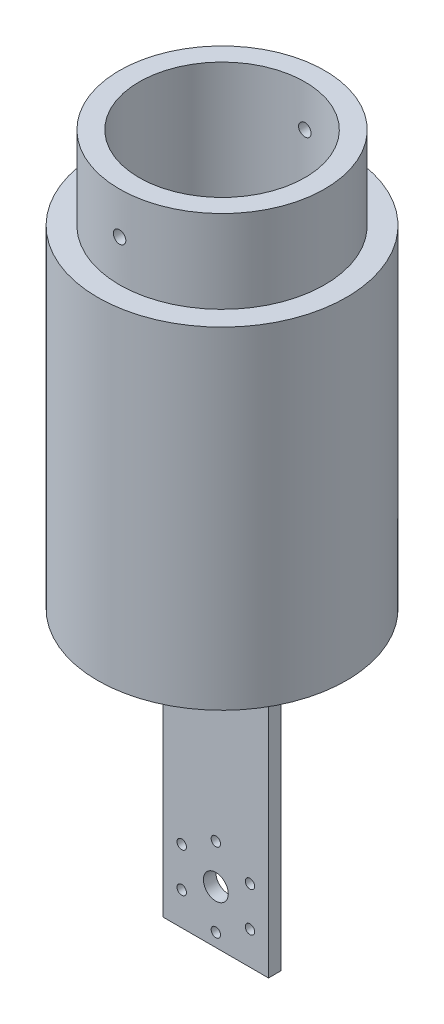
ISO-10303-21;
HEADER;
FILE_DESCRIPTION(('STEP AP214'),'2;1');
FILE_NAME('part.step','',(''),(''),'','','');
FILE_SCHEMA(('AUTOMOTIVE_DESIGN { 1 0 10303 214 1 1 1 1 }'));
ENDSEC;
DATA;
#1=APPLICATION_CONTEXT('core data for automotive mechanical design processes');
#2=APPLICATION_PROTOCOL_DEFINITION('international standard','automotive_design',2000,#1);
#3=PRODUCT_CONTEXT('',#1,'mechanical');
#4=PRODUCT('Part','Part','',(#3));
#5=PRODUCT_RELATED_PRODUCT_CATEGORY('part','',(#4));
#6=PRODUCT_DEFINITION_FORMATION('','',#4);
#7=PRODUCT_DEFINITION_CONTEXT('part definition',#1,'design');
#8=PRODUCT_DEFINITION('design','',#6,#7);
#9=PRODUCT_DEFINITION_SHAPE('','',#8);
#10=(LENGTH_UNIT() NAMED_UNIT(*) SI_UNIT(.MILLI.,.METRE.));
#11=(NAMED_UNIT(*) PLANE_ANGLE_UNIT() SI_UNIT($,.RADIAN.));
#12=(NAMED_UNIT(*) SI_UNIT($,.STERADIAN.) SOLID_ANGLE_UNIT());
#13=UNCERTAINTY_MEASURE_WITH_UNIT(LENGTH_MEASURE(1.E-05),#10,'distance_accuracy_value','');
#14=(GEOMETRIC_REPRESENTATION_CONTEXT(3) GLOBAL_UNCERTAINTY_ASSIGNED_CONTEXT((#13)) GLOBAL_UNIT_ASSIGNED_CONTEXT((#10,
#11,#12)) REPRESENTATION_CONTEXT('',''));
#15=CARTESIAN_POINT('',(0.,0.,0.));
#16=DIRECTION('',(0.,0.,1.));
#17=DIRECTION('',(1.,0.,0.));
#18=AXIS2_PLACEMENT_3D('',#15,#16,#17);
#19=CARTESIAN_POINT('',(12.7,150.,-1.5));
#20=DIRECTION('',(0.,1.,0.));
#21=DIRECTION('',(0.,0.,1.));
#22=AXIS2_PLACEMENT_3D('',#19,#20,#21);
#23=PLANE('',#22);
#24=CARTESIAN_POINT('',(12.7,150.,-1.5));
#25=DIRECTION('',(0.,1.,0.));
#26=DIRECTION('',(0.,0.,1.));
#27=AXIS2_PLACEMENT_3D('',#24,#25,#26);
#28=CIRCLE('',#27,30.);
#29=CARTESIAN_POINT('',(12.7,150.,28.5));
#30=VERTEX_POINT('',#29);
#31=EDGE_CURVE('E229',#30,#30,#28,.T.);
#32=ORIENTED_EDGE('',*,*,#31,.T.);
#33=EDGE_LOOP('',(#32));
#34=FACE_BOUND('',#33,.T.);
#35=CARTESIAN_POINT('',(12.7,150.,-1.5));
#36=DIRECTION('',(0.,1.,0.));
#37=DIRECTION('',(0.,0.,1.));
#38=AXIS2_PLACEMENT_3D('',#35,#36,#37);
#39=CIRCLE('',#38,24.75);
#40=CARTESIAN_POINT('',(12.7,150.,23.25));
#41=VERTEX_POINT('',#40);
#42=EDGE_CURVE('E232',#41,#41,#39,.T.);
#43=ORIENTED_EDGE('',*,*,#42,.F.);
#44=EDGE_LOOP('',(#43));
#45=FACE_BOUND('',#44,.T.);
#46=ADVANCED_FACE('F35',(#34,#45),#23,.T.);
#47=CARTESIAN_POINT('',(0.,70.,-3.));
#48=DIRECTION('',(1.,0.,0.));
#49=DIRECTION('',(0.,0.,-1.));
#50=AXIS2_PLACEMENT_3D('',#47,#48,#49);
#51=PLANE('',#50);
#52=DIRECTION('',(0.,0.,1.));
#53=VECTOR('',#52,1.);
#54=CARTESIAN_POINT('',(0.,0.,-3.));
#55=LINE('',#54,#53);
#56=CARTESIAN_POINT('',(0.,0.,-3.));
#57=VERTEX_POINT('',#56);
#58=CARTESIAN_POINT('',(0.,0.,0.));
#59=VERTEX_POINT('',#58);
#60=EDGE_CURVE('E104',#57,#59,#55,.T.);
#61=ORIENTED_EDGE('',*,*,#60,.T.);
#62=DIRECTION('',(0.,-1.,0.));
#63=VECTOR('',#62,1.);
#64=CARTESIAN_POINT('',(0.,70.,0.));
#65=LINE('',#64,#63);
#66=CARTESIAN_POINT('',(0.,70.,0.));
#67=VERTEX_POINT('',#66);
#68=EDGE_CURVE('E45',#67,#59,#65,.T.);
#69=ORIENTED_EDGE('',*,*,#68,.F.);
#70=DIRECTION('',(0.,0.,1.));
#71=VECTOR('',#70,1.);
#72=CARTESIAN_POINT('',(0.,70.,-3.));
#73=LINE('',#72,#71);
#74=CARTESIAN_POINT('',(0.,70.,-3.));
#75=VERTEX_POINT('',#74);
#76=EDGE_CURVE('E87',#75,#67,#73,.T.);
#77=ORIENTED_EDGE('',*,*,#76,.F.);
#78=DIRECTION('',(0.,-1.,0.));
#79=VECTOR('',#78,1.);
#80=CARTESIAN_POINT('',(0.,70.,-3.));
#81=LINE('',#80,#79);
#82=EDGE_CURVE('E89',#75,#57,#81,.T.);
#83=ORIENTED_EDGE('',*,*,#82,.T.);
#84=EDGE_LOOP('',(#61,#69,#77,#83));
#85=FACE_BOUND('',#84,.T.);
#86=ADVANCED_FACE('F37',(#85),#51,.F.);
#87=CARTESIAN_POINT('',(0.,70.,0.));
#88=DIRECTION('',(0.,0.,-1.));
#89=DIRECTION('',(-1.,0.,0.));
#90=AXIS2_PLACEMENT_3D('',#87,#88,#89);
#91=PLANE('',#90);
#92=CARTESIAN_POINT('',(12.7,12.7,0.));
#93=DIRECTION('',(0.,0.,1.));
#94=DIRECTION('',(1.,0.,0.));
#95=AXIS2_PLACEMENT_3D('',#92,#93,#94);
#96=CIRCLE('',#95,3.);
#97=CARTESIAN_POINT('',(15.7,12.7,0.));
#98=VERTEX_POINT('',#97);
#99=EDGE_CURVE('E202',#98,#98,#96,.T.);
#100=ORIENTED_EDGE('',*,*,#99,.F.);
#101=EDGE_LOOP('',(#100));
#102=FACE_BOUND('',#101,.T.);
#103=CARTESIAN_POINT('',(12.7,22.2,0.));
#104=DIRECTION('',(0.,0.,1.));
#105=DIRECTION('',(1.,0.,0.));
#106=AXIS2_PLACEMENT_3D('',#103,#104,#105);
#107=CIRCLE('',#106,1.13029999999999);
#108=CARTESIAN_POINT('',(13.8303,22.2,0.));
#109=VERTEX_POINT('',#108);
#110=EDGE_CURVE('E206',#109,#109,#107,.T.);
#111=ORIENTED_EDGE('',*,*,#110,.F.);
#112=EDGE_LOOP('',(#111));
#113=FACE_BOUND('',#112,.T.);
#114=CARTESIAN_POINT('',(20.9272413359524,17.4500000000003,0.));
#115=DIRECTION('',(0.,0.,1.));
#116=DIRECTION('',(1.,0.,0.));
#117=AXIS2_PLACEMENT_3D('',#114,#115,#116);
#118=CIRCLE('',#117,1.13029999999999);
#119=CARTESIAN_POINT('',(22.0575413359524,17.4500000000003,0.));
#120=VERTEX_POINT('',#119);
#121=EDGE_CURVE('E210',#120,#120,#118,.T.);
#122=ORIENTED_EDGE('',*,*,#121,.F.);
#123=EDGE_LOOP('',(#122));
#124=FACE_BOUND('',#123,.T.);
#125=CARTESIAN_POINT('',(20.9272413359527,7.95000000000028,0.));
#126=DIRECTION('',(0.,0.,1.));
#127=DIRECTION('',(1.,0.,0.));
#128=AXIS2_PLACEMENT_3D('',#125,#126,#127);
#129=CIRCLE('',#128,1.13029999999999);
#130=CARTESIAN_POINT('',(22.0575413359527,7.95000000000028,0.));
#131=VERTEX_POINT('',#130);
#132=EDGE_CURVE('E214',#131,#131,#129,.T.);
#133=ORIENTED_EDGE('',*,*,#132,.F.);
#134=EDGE_LOOP('',(#133));
#135=FACE_BOUND('',#134,.T.);
#136=CARTESIAN_POINT('',(12.7000000000007,3.2,0.));
#137=DIRECTION('',(0.,0.,1.));
#138=DIRECTION('',(1.,0.,0.));
#139=AXIS2_PLACEMENT_3D('',#136,#137,#138);
#140=CIRCLE('',#139,1.13029999999999);
#141=CARTESIAN_POINT('',(13.8303000000007,3.2,0.));
#142=VERTEX_POINT('',#141);
#143=EDGE_CURVE('E218',#142,#142,#140,.T.);
#144=ORIENTED_EDGE('',*,*,#143,.F.);
#145=EDGE_LOOP('',(#144));
#146=FACE_BOUND('',#145,.T.);
#147=CARTESIAN_POINT('',(4.47275866404834,7.94999999999975,0.));
#148=DIRECTION('',(0.,0.,1.));
#149=DIRECTION('',(1.,0.,0.));
#150=AXIS2_PLACEMENT_3D('',#147,#148,#149);
#151=CIRCLE('',#150,1.13029999999999);
#152=CARTESIAN_POINT('',(5.60305866404833,7.94999999999975,0.));
#153=VERTEX_POINT('',#152);
#154=EDGE_CURVE('E222',#153,#153,#151,.T.);
#155=ORIENTED_EDGE('',*,*,#154,.F.);
#156=EDGE_LOOP('',(#155));
#157=FACE_BOUND('',#156,.T.);
#158=CARTESIAN_POINT('',(4.47275866404807,17.4499999999998,0.));
#159=DIRECTION('',(0.,0.,1.));
#160=DIRECTION('',(1.,0.,0.));
#161=AXIS2_PLACEMENT_3D('',#158,#159,#160);
#162=CIRCLE('',#161,1.13029999999999);
#163=CARTESIAN_POINT('',(5.60305866404806,17.4499999999998,0.));
#164=VERTEX_POINT('',#163);
#165=EDGE_CURVE('E225',#164,#164,#162,.T.);
#166=ORIENTED_EDGE('',*,*,#165,.F.);
#167=EDGE_LOOP('',(#166));
#168=FACE_BOUND('',#167,.T.);
#169=DIRECTION('',(1.,0.,0.));
#170=VECTOR('',#169,1.);
#171=CARTESIAN_POINT('',(0.,0.,0.));
#172=LINE('',#171,#170);
#173=CARTESIAN_POINT('',(25.4,0.,0.));
#174=VERTEX_POINT('',#173);
#175=EDGE_CURVE('E106',#59,#174,#172,.T.);
#176=ORIENTED_EDGE('',*,*,#175,.T.);
#177=DIRECTION('',(0.,-1.,0.));
#178=VECTOR('',#177,1.);
#179=CARTESIAN_POINT('',(25.4,70.,0.));
#180=LINE('',#179,#178);
#181=CARTESIAN_POINT('',(25.4,70.,0.));
#182=VERTEX_POINT('',#181);
#183=EDGE_CURVE('E112',#182,#174,#180,.T.);
#184=ORIENTED_EDGE('',*,*,#183,.F.);
#185=DIRECTION('',(1.,0.,0.));
#186=VECTOR('',#185,1.);
#187=CARTESIAN_POINT('',(0.,70.,0.));
#188=LINE('',#187,#186);
#189=EDGE_CURVE('E81',#67,#182,#188,.T.);
#190=ORIENTED_EDGE('',*,*,#189,.F.);
#191=ORIENTED_EDGE('',*,*,#68,.T.);
#192=EDGE_LOOP('',(#176,#184,#190,#191));
#193=FACE_BOUND('',#192,.T.);
#194=ADVANCED_FACE('F176',(#102,#113,#124,#135,#146,#157,#168,#193),#91,.F.);
#195=CARTESIAN_POINT('',(25.4,70.,0.));
#196=DIRECTION('',(-1.,0.,0.));
#197=DIRECTION('',(0.,0.,1.));
#198=AXIS2_PLACEMENT_3D('',#195,#196,#197);
#199=PLANE('',#198);
#200=DIRECTION('',(0.,0.,-1.));
#201=VECTOR('',#200,1.);
#202=CARTESIAN_POINT('',(25.4,0.,0.));
#203=LINE('',#202,#201);
#204=CARTESIAN_POINT('',(25.4,0.,-3.));
#205=VERTEX_POINT('',#204);
#206=EDGE_CURVE('E70',#174,#205,#203,.T.);
#207=ORIENTED_EDGE('',*,*,#206,.T.);
#208=DIRECTION('',(0.,-1.,0.));
#209=VECTOR('',#208,1.);
#210=CARTESIAN_POINT('',(25.4,70.,-3.));
#211=LINE('',#210,#209);
#212=CARTESIAN_POINT('',(25.4,70.,-3.));
#213=VERTEX_POINT('',#212);
#214=EDGE_CURVE('E54',#213,#205,#211,.T.);
#215=ORIENTED_EDGE('',*,*,#214,.F.);
#216=DIRECTION('',(0.,0.,-1.));
#217=VECTOR('',#216,1.);
#218=CARTESIAN_POINT('',(25.4,70.,0.));
#219=LINE('',#218,#217);
#220=EDGE_CURVE('E99',#182,#213,#219,.T.);
#221=ORIENTED_EDGE('',*,*,#220,.F.);
#222=ORIENTED_EDGE('',*,*,#183,.T.);
#223=EDGE_LOOP('',(#207,#215,#221,#222));
#224=FACE_BOUND('',#223,.T.);
#225=ADVANCED_FACE('F192',(#224),#199,.F.);
#226=CARTESIAN_POINT('',(25.4,70.,-3.));
#227=DIRECTION('',(0.,0.,1.));
#228=DIRECTION('',(1.,0.,0.));
#229=AXIS2_PLACEMENT_3D('',#226,#227,#228);
#230=PLANE('',#229);
#231=CARTESIAN_POINT('',(12.7,12.7,-3.));
#232=DIRECTION('',(0.,0.,1.));
#233=DIRECTION('',(1.,0.,0.));
#234=AXIS2_PLACEMENT_3D('',#231,#232,#233);
#235=CIRCLE('',#234,3.);
#236=CARTESIAN_POINT('',(15.7,12.7,-3.));
#237=VERTEX_POINT('',#236);
#238=EDGE_CURVE('E39',#237,#237,#235,.T.);
#239=ORIENTED_EDGE('',*,*,#238,.T.);
#240=EDGE_LOOP('',(#239));
#241=FACE_BOUND('',#240,.T.);
#242=CARTESIAN_POINT('',(12.7,22.2,-3.));
#243=DIRECTION('',(0.,0.,1.));
#244=DIRECTION('',(1.,0.,0.));
#245=AXIS2_PLACEMENT_3D('',#242,#243,#244);
#246=CIRCLE('',#245,1.13029999999999);
#247=CARTESIAN_POINT('',(13.8303,22.2,-3.));
#248=VERTEX_POINT('',#247);
#249=EDGE_CURVE('E425',#248,#248,#246,.T.);
#250=ORIENTED_EDGE('',*,*,#249,.T.);
#251=EDGE_LOOP('',(#250));
#252=FACE_BOUND('',#251,.T.);
#253=CARTESIAN_POINT('',(20.9272413359524,17.4500000000003,-3.));
#254=DIRECTION('',(0.,0.,1.));
#255=DIRECTION('',(1.,0.,0.));
#256=AXIS2_PLACEMENT_3D('',#253,#254,#255);
#257=CIRCLE('',#256,1.13029999999999);
#258=CARTESIAN_POINT('',(22.0575413359524,17.4500000000003,-3.));
#259=VERTEX_POINT('',#258);
#260=EDGE_CURVE('E432',#259,#259,#257,.T.);
#261=ORIENTED_EDGE('',*,*,#260,.T.);
#262=EDGE_LOOP('',(#261));
#263=FACE_BOUND('',#262,.T.);
#264=CARTESIAN_POINT('',(20.9272413359527,7.95000000000028,-3.));
#265=DIRECTION('',(0.,0.,1.));
#266=DIRECTION('',(1.,0.,0.));
#267=AXIS2_PLACEMENT_3D('',#264,#265,#266);
#268=CIRCLE('',#267,1.13029999999999);
#269=CARTESIAN_POINT('',(22.0575413359527,7.95000000000028,-3.));
#270=VERTEX_POINT('',#269);
#271=EDGE_CURVE('E436',#270,#270,#268,.T.);
#272=ORIENTED_EDGE('',*,*,#271,.T.);
#273=EDGE_LOOP('',(#272));
#274=FACE_BOUND('',#273,.T.);
#275=CARTESIAN_POINT('',(12.7000000000007,3.2,-3.));
#276=DIRECTION('',(0.,0.,1.));
#277=DIRECTION('',(1.,0.,0.));
#278=AXIS2_PLACEMENT_3D('',#275,#276,#277);
#279=CIRCLE('',#278,1.13029999999999);
#280=CARTESIAN_POINT('',(13.8303000000007,3.2,-3.));
#281=VERTEX_POINT('',#280);
#282=EDGE_CURVE('E438',#281,#281,#279,.T.);
#283=ORIENTED_EDGE('',*,*,#282,.T.);
#284=EDGE_LOOP('',(#283));
#285=FACE_BOUND('',#284,.T.);
#286=CARTESIAN_POINT('',(4.47275866404834,7.94999999999975,-3.));
#287=DIRECTION('',(0.,0.,1.));
#288=DIRECTION('',(1.,0.,0.));
#289=AXIS2_PLACEMENT_3D('',#286,#287,#288);
#290=CIRCLE('',#289,1.13029999999999);
#291=CARTESIAN_POINT('',(5.60305866404833,7.94999999999975,-3.));
#292=VERTEX_POINT('',#291);
#293=EDGE_CURVE('E442',#292,#292,#290,.T.);
#294=ORIENTED_EDGE('',*,*,#293,.T.);
#295=EDGE_LOOP('',(#294));
#296=FACE_BOUND('',#295,.T.);
#297=CARTESIAN_POINT('',(4.47275866404807,17.4499999999998,-3.));
#298=DIRECTION('',(0.,0.,1.));
#299=DIRECTION('',(1.,0.,0.));
#300=AXIS2_PLACEMENT_3D('',#297,#298,#299);
#301=CIRCLE('',#300,1.13029999999999);
#302=CARTESIAN_POINT('',(5.60305866404806,17.4499999999998,-3.));
#303=VERTEX_POINT('',#302);
#304=EDGE_CURVE('E123',#303,#303,#301,.T.);
#305=ORIENTED_EDGE('',*,*,#304,.T.);
#306=EDGE_LOOP('',(#305));
#307=FACE_BOUND('',#306,.T.);
#308=DIRECTION('',(-1.,0.,0.));
#309=VECTOR('',#308,1.);
#310=CARTESIAN_POINT('',(25.4,0.,-3.));
#311=LINE('',#310,#309);
#312=EDGE_CURVE('E75',#205,#57,#311,.T.);
#313=ORIENTED_EDGE('',*,*,#312,.T.);
#314=ORIENTED_EDGE('',*,*,#82,.F.);
#315=DIRECTION('',(-1.,0.,0.));
#316=VECTOR('',#315,1.);
#317=CARTESIAN_POINT('',(25.4,70.,-3.));
#318=LINE('',#317,#316);
#319=EDGE_CURVE('E95',#213,#75,#318,.T.);
#320=ORIENTED_EDGE('',*,*,#319,.F.);
#321=ORIENTED_EDGE('',*,*,#214,.T.);
#322=EDGE_LOOP('',(#313,#314,#320,#321));
#323=FACE_BOUND('',#322,.T.);
#324=ADVANCED_FACE('F94',(#241,#252,#263,#274,#285,#296,#307,#323),#230,.F.);
#325=CARTESIAN_POINT('',(0.,0.,0.));
#326=DIRECTION('',(0.,1.,0.));
#327=DIRECTION('',(0.,0.,1.));
#328=AXIS2_PLACEMENT_3D('',#325,#326,#327);
#329=PLANE('',#328);
#330=ORIENTED_EDGE('',*,*,#60,.F.);
#331=ORIENTED_EDGE('',*,*,#312,.F.);
#332=ORIENTED_EDGE('',*,*,#206,.F.);
#333=ORIENTED_EDGE('',*,*,#175,.F.);
#334=EDGE_LOOP('',(#330,#331,#332,#333));
#335=FACE_BOUND('',#334,.T.);
#336=ADVANCED_FACE('F182',(#335),#329,.F.);
#337=CARTESIAN_POINT('',(12.7,70.,-1.5));
#338=DIRECTION('',(0.,1.,0.));
#339=DIRECTION('',(0.,0.,1.));
#340=AXIS2_PLACEMENT_3D('',#337,#338,#339);
#341=PLANE('',#340);
#342=CARTESIAN_POINT('',(12.7,70.,-1.5));
#343=DIRECTION('',(0.,1.,0.));
#344=DIRECTION('',(0.,0.,1.));
#345=AXIS2_PLACEMENT_3D('',#342,#343,#344);
#346=CIRCLE('',#345,30.);
#347=CARTESIAN_POINT('',(12.7,70.,28.5));
#348=VERTEX_POINT('',#347);
#349=EDGE_CURVE('E107',#348,#348,#346,.T.);
#350=ORIENTED_EDGE('',*,*,#349,.F.);
#351=EDGE_LOOP('',(#350));
#352=FACE_BOUND('',#351,.T.);
#353=ORIENTED_EDGE('',*,*,#319,.T.);
#354=ORIENTED_EDGE('',*,*,#76,.T.);
#355=ORIENTED_EDGE('',*,*,#189,.T.);
#356=ORIENTED_EDGE('',*,*,#220,.T.);
#357=EDGE_LOOP('',(#353,#354,#355,#356));
#358=FACE_BOUND('',#357,.T.);
#359=ADVANCED_FACE('F98',(#352,#358),#341,.F.);
#360=CARTESIAN_POINT('',(12.7,80.,-1.5));
#361=DIRECTION('',(0.,-1.,0.));
#362=DIRECTION('',(0.,0.,-1.));
#363=AXIS2_PLACEMENT_3D('',#360,#361,#362);
#364=CYLINDRICAL_SURFACE('',#363,30.);
#365=ORIENTED_EDGE('',*,*,#349,.T.);
#366=EDGE_LOOP('',(#365));
#367=FACE_BOUND('',#366,.T.);
#368=ORIENTED_EDGE('',*,*,#31,.F.);
#369=EDGE_LOOP('',(#368));
#370=FACE_BOUND('',#369,.T.);
#371=ADVANCED_FACE('F167',(#367,#370),#364,.T.);
#372=CARTESIAN_POINT('',(12.7,170.,-1.5));
#373=DIRECTION('',(0.,1.,0.));
#374=DIRECTION('',(0.,0.,1.));
#375=AXIS2_PLACEMENT_3D('',#372,#373,#374);
#376=PLANE('',#375);
#377=CARTESIAN_POINT('',(12.7,170.,-1.5));
#378=DIRECTION('',(0.,1.,0.));
#379=DIRECTION('',(0.,0.,1.));
#380=AXIS2_PLACEMENT_3D('',#377,#378,#379);
#381=CIRCLE('',#380,24.75);
#382=CARTESIAN_POINT('',(12.7,170.,23.25));
#383=VERTEX_POINT('',#382);
#384=EDGE_CURVE('E231',#383,#383,#381,.T.);
#385=ORIENTED_EDGE('',*,*,#384,.T.);
#386=EDGE_LOOP('',(#385));
#387=FACE_BOUND('',#386,.T.);
#388=CARTESIAN_POINT('',(12.7,170.,-1.5));
#389=DIRECTION('',(0.,1.,0.));
#390=DIRECTION('',(0.,0.,1.));
#391=AXIS2_PLACEMENT_3D('',#388,#389,#390);
#392=CIRCLE('',#391,20.);
#393=CARTESIAN_POINT('',(12.7,170.,18.5));
#394=VERTEX_POINT('',#393);
#395=EDGE_CURVE('E235',#394,#394,#392,.T.);
#396=ORIENTED_EDGE('',*,*,#395,.F.);
#397=EDGE_LOOP('',(#396));
#398=FACE_BOUND('',#397,.T.);
#399=ADVANCED_FACE('F139',(#387,#398),#376,.T.);
#400=CARTESIAN_POINT('',(12.7,170.,-1.5));
#401=DIRECTION('',(0.,-1.,0.));
#402=DIRECTION('',(0.,0.,-1.));
#403=AXIS2_PLACEMENT_3D('',#400,#401,#402);
#404=CYLINDRICAL_SURFACE('',#403,24.75);
#405=CARTESIAN_POINT('',(12.7,161.5,-26.25));
#406=CARTESIAN_POINT('',(12.6158272360017,161.499996294486,-26.2499993950914));
#407=CARTESIAN_POINT('',(12.5315954094542,161.492891139931,-26.2495660095077));
#408=CARTESIAN_POINT('',(12.3654572276667,161.4646490504,-26.2478788134059));
#409=CARTESIAN_POINT('',(12.2835537009014,161.443495750373,-26.2466240460632));
#410=CARTESIAN_POINT('',(12.1245027112469,161.387766852012,-26.2434360460326));
#411=CARTESIAN_POINT('',(12.0473527781471,161.353198294272,-26.2415031692811));
#412=CARTESIAN_POINT('',(11.8999708290897,161.271631471199,-26.2371763936826));
#413=CARTESIAN_POINT('',(11.8297372258387,161.224636066986,-26.23478260099));
#414=CARTESIAN_POINT('',(11.6980618011794,161.119476457361,-26.2297993091298));
#415=CARTESIAN_POINT('',(11.6366310616504,161.061298386054,-26.2272095694415));
#416=CARTESIAN_POINT('',(11.5243998825831,160.935453368007,-26.2221283187087));
#417=CARTESIAN_POINT('',(11.4735998855726,160.86778602645,-26.2196368117569));
#418=CARTESIAN_POINT('',(11.3840385183647,160.724821118673,-26.2150311605046));
#419=CARTESIAN_POINT('',(11.345286285553,160.649517818234,-26.2129173031392));
#420=CARTESIAN_POINT('',(11.2809789669607,160.493458800333,-26.2093084213148));
#421=CARTESIAN_POINT('',(11.2554237461974,160.412703138648,-26.2078133905262));
#422=CARTESIAN_POINT('',(11.2182664452143,160.248137927824,-26.2056130328204));
#423=CARTESIAN_POINT('',(11.206647100142,160.164332290202,-26.2049067288416));
#424=CARTESIAN_POINT('',(11.1976380890256,159.995957360624,-26.2043605474928));
#425=CARTESIAN_POINT('',(11.20024826993,159.911388076891,-26.2045206608035));
#426=CARTESIAN_POINT('',(11.219609882258,159.744004060495,-26.2056883508244));
#427=CARTESIAN_POINT('',(11.2363426356229,159.661187158413,-26.2066948081807));
#428=CARTESIAN_POINT('',(11.2834454445906,159.499539764978,-26.2094399992608));
#429=CARTESIAN_POINT('',(11.3138155779227,159.42070929635,-26.2111787371583));
#430=CARTESIAN_POINT('',(11.3873522752411,159.269212444,-26.2151938288594));
#431=CARTESIAN_POINT('',(11.4305273191898,159.196550186278,-26.2174705387273));
#432=CARTESIAN_POINT('',(11.5284421063176,159.059497482265,-26.2223046401809));
#433=CARTESIAN_POINT('',(11.583181971493,158.995107123245,-26.2248620347275));
#434=CARTESIAN_POINT('',(11.7027777691438,158.876317343704,-26.2299742683419));
#435=CARTESIAN_POINT('',(11.7676498679828,158.821934197442,-26.2325290966432));
#436=CARTESIAN_POINT('',(11.9056119544538,158.724828091665,-26.2373443140455));
#437=CARTESIAN_POINT('',(11.9787019448001,158.682105136001,-26.2396047030492));
#438=CARTESIAN_POINT('',(12.1310348697164,158.609533567534,-26.2435764892667));
#439=CARTESIAN_POINT('',(12.2102780948214,158.57968556308,-26.2452878605381));
#440=CARTESIAN_POINT('',(12.3726636862774,158.533722005188,-26.2479684060267));
#441=CARTESIAN_POINT('',(12.4558060097927,158.517606300923,-26.2489375883956));
#442=CARTESIAN_POINT('',(12.6234884777102,158.499584956968,-26.2500234915826));
#443=CARTESIAN_POINT('',(12.7080261953728,158.497656815031,-26.2501415623043));
#444=CARTESIAN_POINT('',(12.8762238796143,158.5080065456,-26.2495155265069));
#445=CARTESIAN_POINT('',(12.9598838504826,158.520284348654,-26.2487714242029));
#446=CARTESIAN_POINT('',(13.1238879059211,158.55867881678,-26.246505685668));
#447=CARTESIAN_POINT('',(13.2042344141761,158.584785166028,-26.2449846290597));
#448=CARTESIAN_POINT('',(13.3594055841374,158.650085188851,-26.2413361268423));
#449=CARTESIAN_POINT('',(13.4342301991168,158.689278973159,-26.2392086761024));
#450=CARTESIAN_POINT('',(13.5763366773499,158.77969863508,-26.2345831167613));
#451=CARTESIAN_POINT('',(13.6436089570357,158.830939550565,-26.2320845463557));
#452=CARTESIAN_POINT('',(13.7686046948817,158.94397703099,-26.2269995153587));
#453=CARTESIAN_POINT('',(13.8263280644694,159.005773693829,-26.2244130539523));
#454=CARTESIAN_POINT('',(13.9306635751308,159.138265524633,-26.2194398545461));
#455=CARTESIAN_POINT('',(13.9772611242699,159.208972194844,-26.2170533814707));
#456=CARTESIAN_POINT('',(14.0579224609094,159.357219075791,-26.2127534913119));
#457=CARTESIAN_POINT('',(14.0919863219554,159.434759246425,-26.2108400714529));
#458=CARTESIAN_POINT('',(14.1465880374304,159.594418622786,-26.2077039742724));
#459=CARTESIAN_POINT('',(14.1671350955915,159.676534671339,-26.2064808270181));
#460=CARTESIAN_POINT('',(14.1941500157145,159.843058740904,-26.2048619041938));
#461=CARTESIAN_POINT('',(14.2006180074679,159.92746674078,-26.2044661209966));
#462=CARTESIAN_POINT('',(14.1992899500819,160.096033564037,-26.204546743532));
#463=CARTESIAN_POINT('',(14.1915168437835,160.180192569806,-26.2050217464026));
#464=CARTESIAN_POINT('',(14.1619747840538,160.346008156434,-26.2067874414229));
#465=CARTESIAN_POINT('',(14.1402058050221,160.427664732714,-26.2080781350647));
#466=CARTESIAN_POINT('',(14.0832950354252,160.586161191196,-26.211329419094));
#467=CARTESIAN_POINT('',(14.0481533032494,160.663001094427,-26.2132900065566));
#468=CARTESIAN_POINT('',(13.9654978304686,160.809692950927,-26.2176600931866));
#469=CARTESIAN_POINT('',(13.9179844201053,160.879545090654,-26.2200695803708));
#470=CARTESIAN_POINT('',(13.811849819092,161.010394705925,-26.2250704477495));
#471=CARTESIAN_POINT('',(13.7532121138786,161.071378775536,-26.2276620947218));
#472=CARTESIAN_POINT('',(13.626514263525,161.18265837378,-26.2327330054645));
#473=CARTESIAN_POINT('',(13.5584518144774,161.232951281282,-26.2352122415584));
#474=CARTESIAN_POINT('',(13.4147630468485,161.32145569831,-26.2397813915809));
#475=CARTESIAN_POINT('',(13.3391278197508,161.359652753332,-26.2418708384972));
#476=CARTESIAN_POINT('',(13.1825603089578,161.422759108663,-26.2454185983165));
#477=CARTESIAN_POINT('',(13.1016343636289,161.447683993214,-26.2468776510496));
#478=CARTESIAN_POINT('',(12.9668433635005,161.477050421526,-26.2486172790852));
#479=CARTESIAN_POINT('',(12.9138498909513,161.485645408483,-26.2491334992661));
#480=CARTESIAN_POINT('',(12.8072456053096,161.497121374603,-26.2498250522267));
#481=CARTESIAN_POINT('',(12.7536347930151,161.500002361149,-26.2500003854471));
#482=CARTESIAN_POINT('',(12.7,161.5,-26.25));
#483=B_SPLINE_CURVE_WITH_KNOTS('',3,(#405,#406,#407,#408,#409,#410,#411,#412,#413,#414,#415,
#416,#417,#418,#419,#420,#421,#422,#423,#424,#425,#426,#427,#428,#429,#430,#431,#432,#433,#434,
#435,#436,#437,#438,#439,#440,#441,#442,#443,#444,#445,#446,#447,#448,#449,#450,#451,#452,#453,
#454,#455,#456,#457,#458,#459,#460,#461,#462,#463,#464,#465,#466,#467,#468,#469,#470,#471,#472,
#473,#474,#475,#476,#477,#478,#479,#480,#481,#482),.UNSPECIFIED.,.T.,.F.,(4,2,2,2,2,2,2,2,2,2,2,
2,2,2,2,2,2,2,2,2,2,2,2,2,2,2,2,2,2,2,2,2,2,2,2,2,2,2,4),(0.,0.252322495126928,
0.504939444144783,0.7574239936502,1.0098504623989,1.26259196913434,1.51534399469492,
1.76828724994961,2.0212279179803,2.27385489857239,2.52647916193554,2.77876983520992,
3.03106194648941,3.28352151095256,3.53598373872267,3.78885297388349,4.04172229256833,
4.29460355816119,4.54748204623717,4.79995936860501,5.0524354566224,5.30472346714171,
5.55701361230943,5.80962036737493,6.0622294654049,6.31516807199719,6.56810519436738,
6.82086991045434,7.07363229635482,7.32598783240442,7.57834383004985,7.83069872584553,
8.08304688612808,8.33577264347983,8.58856028983778,8.84164888651133,9.09443964639671,
9.25521947166412,9.41599908915951),.UNSPECIFIED.);
#484=CARTESIAN_POINT('',(12.7,161.5,-26.25));
#485=VERTEX_POINT('',#484);
#486=EDGE_CURVE('E150',#485,#485,#483,.T.);
#487=ORIENTED_EDGE('',*,*,#486,.T.);
#488=EDGE_LOOP('',(#487));
#489=FACE_BOUND('',#488,.T.);
#490=CARTESIAN_POINT('',(14.2,160.,23.2045036380009));
#491=CARTESIAN_POINT('',(14.199996294341,159.915827396093,23.204504247067));
#492=CARTESIAN_POINT('',(14.1928911658982,159.831595729099,23.2049384501491));
#493=CARTESIAN_POINT('',(14.164649189526,159.665457878837,23.2066285670585));
#494=CARTESIAN_POINT('',(14.1434959760001,159.583554524169,23.207885439246));
#495=CARTESIAN_POINT('',(14.0877673307143,159.424503898316,23.211078006911));
#496=CARTESIAN_POINT('',(14.0531989436741,159.347354155463,23.2130133460534));
#497=CARTESIAN_POINT('',(13.9716325225065,159.199972524777,23.2173443279387));
#498=CARTESIAN_POINT('',(13.9246373490764,159.129739049892,23.2197398647076));
#499=CARTESIAN_POINT('',(13.8194779719006,158.998063478667,23.2247251778596));
#500=CARTESIAN_POINT('',(13.7612998507666,158.936632505251,23.2273151938021));
#501=CARTESIAN_POINT('',(13.6354546350811,158.824400875241,23.2323953950117));
#502=CARTESIAN_POINT('',(13.5677871463494,158.773600660459,23.2348855761262));
#503=CARTESIAN_POINT('',(13.4248221112283,158.684039066788,23.2394875451558));
#504=CARTESIAN_POINT('',(13.3495188559153,158.645286784937,23.2415990466346));
#505=CARTESIAN_POINT('',(13.1934599361357,158.580979363209,23.2452032291485));
#506=CARTESIAN_POINT('',(13.1127043272022,158.555424088941,23.2466959164853));
#507=CARTESIAN_POINT('',(12.9481392713536,158.518266674285,23.2488926319667));
#508=CARTESIAN_POINT('',(12.8643337368437,158.506647265004,23.2495976361096));
#509=CARTESIAN_POINT('',(12.6959590086737,158.497638089751,23.2501428302382));
#510=CARTESIAN_POINT('',(12.6113898232005,158.500248171408,23.2499830294842));
#511=CARTESIAN_POINT('',(12.4440053654319,158.519609627973,23.2488174360853));
#512=CARTESIAN_POINT('',(12.3611879353748,158.53634242469,23.2478127548726));
#513=CARTESIAN_POINT('',(12.1995395083258,158.583445503909,23.2450718001535));
#514=CARTESIAN_POINT('',(12.1207085337752,158.613815863172,23.2433355225291));
#515=CARTESIAN_POINT('',(11.9692110734715,158.68735302546,23.2393249695654));
#516=CARTESIAN_POINT('',(11.8965486878467,158.730528255265,23.2370503401408));
#517=CARTESIAN_POINT('',(11.7594958071209,158.828443437552,23.2322191026159));
#518=CARTESIAN_POINT('',(11.6951053993721,158.883183512144,23.2296624915383));
#519=CARTESIAN_POINT('',(11.5763158614867,159.002779456654,23.2245501964392));
#520=CARTESIAN_POINT('',(11.5219329631826,159.067651450614,23.2219945205183));
#521=CARTESIAN_POINT('',(11.424827307471,159.205613239515,23.2171763345571));
#522=CARTESIAN_POINT('',(11.382104554415,159.278703037522,23.2149138246262));
#523=CARTESIAN_POINT('',(11.309533131083,159.431035913932,23.2109374434511));
#524=CARTESIAN_POINT('',(11.2796851323468,159.510279313049,23.2092236008263));
#525=CARTESIAN_POINT('',(11.2337216393706,159.672665282198,23.2065388595969));
#526=CARTESIAN_POINT('',(11.21760599327,159.755807809101,23.2055679527763));
#527=CARTESIAN_POINT('',(11.1995848681371,159.923490365888,23.2044801107233));
#528=CARTESIAN_POINT('',(11.1976568316575,160.008027963077,23.2043618198888));
#529=CARTESIAN_POINT('',(11.2080067301262,160.176225380911,23.204989008739));
#530=CARTESIAN_POINT('',(11.2202845956301,160.259885205844,23.2057344842012));
#531=CARTESIAN_POINT('',(11.2586790412124,160.423888564423,23.208003955339));
#532=CARTESIAN_POINT('',(11.2847852430138,160.504234536464,23.2095273671362));
#533=CARTESIAN_POINT('',(11.3500847910012,160.659404699388,23.2131805339918));
#534=CARTESIAN_POINT('',(11.3892782487823,160.734228843178,23.2153102942205));
#535=CARTESIAN_POINT('',(11.4796974351409,160.876335009239,23.2199394360589));
#536=CARTESIAN_POINT('',(11.5309382846545,160.943607395071,23.2224392806971));
#537=CARTESIAN_POINT('',(11.6439756933689,161.068603377887,23.2275252511428));
#538=CARTESIAN_POINT('',(11.7057723499688,161.126326886754,23.2301113777462));
#539=CARTESIAN_POINT('',(11.8382642433821,161.230662685758,23.2350824439577));
#540=CARTESIAN_POINT('',(11.908970983194,161.277260383131,23.2374671167174));
#541=CARTESIAN_POINT('',(12.0572180416713,161.357921980119,23.2417627286438));
#542=CARTESIAN_POINT('',(12.1347583202284,161.391985953292,23.2436736705908));
#543=CARTESIAN_POINT('',(12.2944176182045,161.446587745753,23.2468052182996));
#544=CARTESIAN_POINT('',(12.3765334638238,161.467134817287,23.2480262961887));
#545=CARTESIAN_POINT('',(12.543057106421,161.494149832963,23.2496424042679));
#546=CARTESIAN_POINT('',(12.6274648824382,161.500617905822,23.25003744201));
#547=CARTESIAN_POINT('',(12.7960318550489,161.499290079646,23.2499569814279));
#548=CARTESIAN_POINT('',(12.8801912332241,161.491517026692,23.2494828774087));
#549=CARTESIAN_POINT('',(13.0460075776631,161.461974942389,23.2477202234912));
#550=CARTESIAN_POINT('',(13.1276645394685,161.440205886106,23.246431672142));
#551=CARTESIAN_POINT('',(13.2861617515555,161.383294822523,23.2431849787432));
#552=CARTESIAN_POINT('',(13.3630020225999,161.348152872873,23.2412268395801));
#553=CARTESIAN_POINT('',(13.509694523592,161.265496851715,23.2368608850492));
#554=CARTESIAN_POINT('',(13.579546940224,161.21798311085,23.2344530816994));
#555=CARTESIAN_POINT('',(13.7103965250108,161.111848152332,23.2294541005294));
#556=CARTESIAN_POINT('',(13.7713803481037,161.053210495272,23.2268626549113));
#557=CARTESIAN_POINT('',(13.8826594715312,160.92651284181,23.221790557251));
#558=CARTESIAN_POINT('',(13.9329521500977,160.858450540963,23.2193099325028));
#559=CARTESIAN_POINT('',(14.0214563275795,160.714761887966,23.2147370123681));
#560=CARTESIAN_POINT('',(14.0596533290409,160.639126600869,23.2126451842102));
#561=CARTESIAN_POINT('',(14.1227595674847,160.482558961626,23.2090927304909));
#562=CARTESIAN_POINT('',(14.1476843895287,160.401632948191,23.2076313649837));
#563=CARTESIAN_POINT('',(14.1770506372667,160.266842116015,23.2058888330602));
#564=CARTESIAN_POINT('',(14.1856455430666,160.21384889229,23.2053717010971));
#565=CARTESIAN_POINT('',(14.1971214013358,160.107245105444,23.2046789097419));
#566=CARTESIAN_POINT('',(14.2000023612353,160.053634543125,23.2045032499057));
#567=CARTESIAN_POINT('',(14.2,160.,23.2045036380009));
#568=B_SPLINE_CURVE_WITH_KNOTS('',3,(#490,#491,#492,#493,#494,#495,#496,#497,#498,#499,#500,
#501,#502,#503,#504,#505,#506,#507,#508,#509,#510,#511,#512,#513,#514,#515,#516,#517,#518,#519,
#520,#521,#522,#523,#524,#525,#526,#527,#528,#529,#530,#531,#532,#533,#534,#535,#536,#537,#538,
#539,#540,#541,#542,#543,#544,#545,#546,#547,#548,#549,#550,#551,#552,#553,#554,#555,#556,#557,
#558,#559,#560,#561,#562,#563,#564,#565,#566,#567),.UNSPECIFIED.,.T.,.F.,(4,2,2,2,2,2,2,2,2,2,2,
2,2,2,2,2,2,2,2,2,2,2,2,2,2,2,2,2,2,2,2,2,2,2,2,2,2,2,4),(0.,0.252322014318652,
0.504938493039601,0.757422494203331,1.00984842303469,1.26259055878275,1.51534319633626,
1.76828621901626,2.02122666582501,2.27385335173717,2.52647733250081,2.77876950773643,
3.03106310305205,3.28352310052394,3.53598576375446,3.78885437125696,4.04172307312868,
4.29460496289288,4.54748405610021,4.79996099968816,5.05243670906845,5.3047232013264,
5.55701184488541,5.80961884778122,6.06222818162637,6.31516704322556,6.56810442033516,
6.82086848252163,7.07363023382985,7.3259868514642,7.57834391867833,7.83069989801187,
8.0830491337164,8.33577424901388,8.58856126827845,8.8416501323617,9.09444114386679,
9.25522022077132,9.41599908860193),.UNSPECIFIED.);
#569=CARTESIAN_POINT('',(14.2,160.,23.2045036380009));
#570=VERTEX_POINT('',#569);
#571=EDGE_CURVE('E145',#570,#570,#568,.T.);
#572=ORIENTED_EDGE('',*,*,#571,.T.);
#573=EDGE_LOOP('',(#572));
#574=FACE_BOUND('',#573,.T.);
#575=ORIENTED_EDGE('',*,*,#384,.F.);
#576=EDGE_LOOP('',(#575));
#577=FACE_BOUND('',#576,.T.);
#578=ORIENTED_EDGE('',*,*,#42,.T.);
#579=EDGE_LOOP('',(#578));
#580=FACE_BOUND('',#579,.T.);
#581=ADVANCED_FACE('F155',(#489,#574,#577,#580),#404,.T.);
#582=CARTESIAN_POINT('',(12.7,80.,-1.5));
#583=DIRECTION('',(0.,1.,0.));
#584=DIRECTION('',(0.,0.,1.));
#585=AXIS2_PLACEMENT_3D('',#582,#583,#584);
#586=PLANE('',#585);
#587=CARTESIAN_POINT('',(12.7,80.,-1.5));
#588=DIRECTION('',(0.,1.,0.));
#589=DIRECTION('',(0.,0.,1.));
#590=AXIS2_PLACEMENT_3D('',#587,#588,#589);
#591=CIRCLE('',#590,20.);
#592=CARTESIAN_POINT('',(12.7,80.,18.5));
#593=VERTEX_POINT('',#592);
#594=EDGE_CURVE('E11',#593,#593,#591,.F.);
#595=ORIENTED_EDGE('',*,*,#594,.F.);
#596=EDGE_LOOP('',(#595));
#597=FACE_BOUND('',#596,.T.);
#598=ADVANCED_FACE('F158',(#597),#586,.T.);
#599=CARTESIAN_POINT('',(12.7,150.,-1.5));
#600=DIRECTION('',(0.,-1.,0.));
#601=DIRECTION('',(0.,0.,-1.));
#602=AXIS2_PLACEMENT_3D('',#599,#600,#601);
#603=CYLINDRICAL_SURFACE('',#602,20.);
#604=CARTESIAN_POINT('',(12.7,161.5,-21.5));
#605=CARTESIAN_POINT('',(12.6158711904886,161.499996313183,-21.4999992582729));
#606=CARTESIAN_POINT('',(12.5316843989759,161.492898546559,-21.4994635090758));
#607=CARTESIAN_POINT('',(12.3656380580285,161.464687515457,-21.4973778078798));
#608=CARTESIAN_POINT('',(12.283781288837,161.443558183763,-21.4958266932389));
#609=CARTESIAN_POINT('',(12.1248240340402,161.38789667188,-21.4918856268593));
#610=CARTESIAN_POINT('',(12.0477209630649,161.353371852892,-21.4894961359011));
#611=CARTESIAN_POINT('',(11.900423519322,161.271912047136,-21.4841466247064));
#612=CARTESIAN_POINT('',(11.8302276282002,161.224979796204,-21.4811867302827));
#613=CARTESIAN_POINT('',(11.6985710424675,161.119930779463,-21.475021868989));
#614=CARTESIAN_POINT('',(11.6371267702815,161.061793455916,-21.471816458291));
#615=CARTESIAN_POINT('',(11.5248583463022,160.936027702655,-21.4655255838438));
#616=CARTESIAN_POINT('',(11.4740346509573,160.868398865226,-21.4624401252546));
#617=CARTESIAN_POINT('',(11.3843961612523,160.725472545191,-21.4567335395977));
#618=CARTESIAN_POINT('',(11.3455955318967,160.65016615497,-21.454112961772));
#619=CARTESIAN_POINT('',(11.2811951095322,160.494084627656,-21.4496376121017));
#620=CARTESIAN_POINT('',(11.2555951231131,160.413309570707,-21.447782829037));
#621=CARTESIAN_POINT('',(11.2183696234207,160.248746107599,-21.4450525889002));
#622=CARTESIAN_POINT('',(11.2067176895578,160.164963709192,-21.4441752805014));
#623=CARTESIAN_POINT('',(11.1976374542516,159.996628046739,-21.4434933892539));
#624=CARTESIAN_POINT('',(11.2002089318914,159.912074794687,-21.4436887897441));
#625=CARTESIAN_POINT('',(11.2194806558243,159.744778188946,-21.4451285636931));
#626=CARTESIAN_POINT('',(11.2361522432361,159.662031513036,-21.4463708093904));
#627=CARTESIAN_POINT('',(11.2831064477308,159.500514302884,-21.4497609519804));
#628=CARTESIAN_POINT('',(11.3133891755266,159.421743800991,-21.4519088562398));
#629=CARTESIAN_POINT('',(11.386738328103,159.270323283761,-21.4568707353614));
#630=CARTESIAN_POINT('',(11.429817672735,159.197679549823,-21.4596853828032));
#631=CARTESIAN_POINT('',(11.5275278625658,159.060643337135,-21.4656629459514));
#632=CARTESIAN_POINT('',(11.5821588965712,158.996250993278,-21.4688258673499));
#633=CARTESIAN_POINT('',(11.7015827215677,158.877378741756,-21.4751530336147));
#634=CARTESIAN_POINT('',(11.7664002998237,158.822923732405,-21.478317262423));
#635=CARTESIAN_POINT('',(11.9042706240656,158.725664236434,-21.4842830152099));
#636=CARTESIAN_POINT('',(11.9773233742814,158.682859755799,-21.4870845390023));
#637=CARTESIAN_POINT('',(12.1296060597837,158.610118169756,-21.4920096041928));
#638=CARTESIAN_POINT('',(12.208836490571,158.580182097759,-21.4941330911371));
#639=CARTESIAN_POINT('',(12.3712183472254,158.534044187795,-21.4974621500133));
#640=CARTESIAN_POINT('',(12.4543697071574,158.517842118962,-21.498667737375));
#641=CARTESIAN_POINT('',(12.6220171562162,158.499663190461,-21.5000231735387));
#642=CARTESIAN_POINT('',(12.7065094948253,158.497651925346,-21.5001755757578));
#643=CARTESIAN_POINT('',(12.8746302309931,158.50782166807,-21.4994142771364));
#644=CARTESIAN_POINT('',(12.9582586350546,158.520002569005,-21.4985005843263));
#645=CARTESIAN_POINT('',(13.1221800111765,158.558182368811,-21.4957115375324));
#646=CARTESIAN_POINT('',(13.2024767016461,158.584165390559,-21.4938372886011));
#647=CARTESIAN_POINT('',(13.357570327384,158.649195693637,-21.4893378090841));
#648=CARTESIAN_POINT('',(13.4323671917994,158.688243143237,-21.4867125688255));
#649=CARTESIAN_POINT('',(13.5744949593768,158.778380837898,-21.4809993255836));
#650=CARTESIAN_POINT('',(13.6418113202556,158.829493956719,-21.4779104477497));
#651=CARTESIAN_POINT('',(13.766920596017,158.942278925469,-21.4716201639251));
#652=CARTESIAN_POINT('',(13.8247133767348,159.003950924123,-21.4684187563499));
#653=CARTESIAN_POINT('',(13.9292523497916,159.136251940132,-21.4622567375937));
#654=CARTESIAN_POINT('',(13.9759761470877,159.206898679433,-21.4592966224009));
#655=CARTESIAN_POINT('',(14.0568974447261,159.355055198382,-21.4539590285433));
#656=CARTESIAN_POINT('',(14.0910950495869,159.432564920758,-21.451581545017));
#657=CARTESIAN_POINT('',(14.1459547923846,159.592166807487,-21.4476809567371));
#658=CARTESIAN_POINT('',(14.1666308067291,159.674254179853,-21.4461569763152));
#659=CARTESIAN_POINT('',(14.1939056933918,159.840747231016,-21.4441328652441));
#660=CARTESIAN_POINT('',(14.2005047790739,159.925152874656,-21.4436327190765));
#661=CARTESIAN_POINT('',(14.1994362155316,160.093663913247,-21.4437130691626));
#662=CARTESIAN_POINT('',(14.1918037608572,160.177769534896,-21.4442908995857));
#663=CARTESIAN_POINT('',(14.162561981934,160.34350108371,-21.4464564369575));
#664=CARTESIAN_POINT('',(14.1409526344339,160.42512700675,-21.4480441455862));
#665=CARTESIAN_POINT('',(14.0843790027353,160.583585608422,-21.452049853556));
#666=CARTESIAN_POINT('',(14.0494151584096,160.660418444833,-21.4544678255495));
#667=CARTESIAN_POINT('',(13.9671292461968,160.807128957715,-21.4598616237908));
#668=CARTESIAN_POINT('',(13.9198074268101,160.877006774002,-21.4628374388209));
#669=CARTESIAN_POINT('',(13.8140170894673,161.008003349971,-21.4690203079162));
#670=CARTESIAN_POINT('',(13.7555226882,161.06910118164,-21.4722278879631));
#671=CARTESIAN_POINT('',(13.6290909734527,161.180634050311,-21.4785081329158));
#672=CARTESIAN_POINT('',(13.5611513677957,161.231066491506,-21.4815807648333));
#673=CARTESIAN_POINT('',(13.4176504166038,161.319891162539,-21.4872494022766));
#674=CARTESIAN_POINT('',(13.3420771482674,161.358264160491,-21.4898446437752));
#675=CARTESIAN_POINT('',(13.1855939179152,161.42172828444,-21.4942566719576));
#676=CARTESIAN_POINT('',(13.1046902637377,161.446834803068,-21.4960743603405));
#677=CARTESIAN_POINT('',(12.9694179167244,161.476601988527,-21.4982556200579));
#678=CARTESIAN_POINT('',(12.915921192938,161.485364718789,-21.4989068154638));
#679=CARTESIAN_POINT('',(12.808290987948,161.497064905152,-21.4997792437292));
#680=CARTESIAN_POINT('',(12.7541575080691,161.50000237337,-21.5000004774832));
#681=CARTESIAN_POINT('',(12.7,161.5,-21.5));
#682=B_SPLINE_CURVE_WITH_KNOTS('',3,(#604,#605,#606,#607,#608,#609,#610,#611,#612,#613,#614,
#615,#616,#617,#618,#619,#620,#621,#622,#623,#624,#625,#626,#627,#628,#629,#630,#631,#632,#633,
#634,#635,#636,#637,#638,#639,#640,#641,#642,#643,#644,#645,#646,#647,#648,#649,#650,#651,#652,
#653,#654,#655,#656,#657,#658,#659,#660,#661,#662,#663,#664,#665,#666,#667,#668,#669,#670,#671,
#672,#673,#674,#675,#676,#677,#678,#679,#680,#681),.UNSPECIFIED.,.T.,.F.,(4,2,2,2,2,2,2,2,2,2,2,
2,2,2,2,2,2,2,2,2,2,2,2,2,2,2,2,2,2,2,2,2,2,2,2,2,2,2,4),(0.,0.252188706341403,0.50466668711607,
0.757006120137031,1.00928995874567,1.2620411413344,1.51480318436673,1.76786189721258,
2.02091690224425,2.27349180470369,2.52606278420135,2.77812163616427,3.0301825384079,
3.28249879898396,3.53481918386621,3.78776333637313,4.04070761880365,4.29367221036426,
4.54663254953897,4.79897937776531,5.05132430518305,5.30337957695229,5.55543809532427,
5.8079783521194,6.06052216631005,6.3135726511564,6.56662102450257,6.81940930006921,
7.07219374409738,7.32435388202406,7.57651443943157,7.82866669184702,8.0808138742512,
8.33355244628149,8.5863524607211,8.83955360771713,9.09246032562225,9.25480590484757,
9.41715114636385),.UNSPECIFIED.);
#683=CARTESIAN_POINT('',(12.7,161.5,-21.5));
#684=VERTEX_POINT('',#683);
#685=EDGE_CURVE('E122',#684,#684,#682,.T.);
#686=ORIENTED_EDGE('',*,*,#685,.F.);
#687=EDGE_LOOP('',(#686));
#688=FACE_BOUND('',#687,.T.);
#689=CARTESIAN_POINT('',(14.2,160.,18.4436706751791));
#690=CARTESIAN_POINT('',(14.199996312844,159.915871565722,18.443671424711));
#691=CARTESIAN_POINT('',(14.1928986073944,159.831685148205,18.4442087219975));
#692=CARTESIAN_POINT('',(14.1646878413798,159.665639584352,18.4462999542359));
#693=CARTESIAN_POINT('',(14.1435587123183,159.583783218552,18.4478550547254));
#694=CARTESIAN_POINT('',(14.0878977932492,159.42482681657,18.4518047691616));
#695=CARTESIAN_POINT('',(14.0533733740953,159.347724191601,18.4541989213442));
#696=CARTESIAN_POINT('',(13.9719145097985,159.200427494542,18.4595563959789));
#697=CARTESIAN_POINT('',(13.924982799502,159.13023190466,18.4625195929615));
#698=CARTESIAN_POINT('',(13.8199343278142,158.998574976216,18.4686882981736));
#699=CARTESIAN_POINT('',(13.7617968880053,158.937130156104,18.4718942476191));
#700=CARTESIAN_POINT('',(13.6360306725068,158.824860675352,18.4781831621206));
#701=CARTESIAN_POINT('',(13.568401490593,158.774036469481,18.4812661219056));
#702=CARTESIAN_POINT('',(13.4254748712688,158.684397447915,18.4869657395593));
#703=CARTESIAN_POINT('',(13.3501685854615,158.645596702905,18.4895818495818));
#704=CARTESIAN_POINT('',(13.1940872851566,158.58119603788,18.4940482820627));
#705=CARTESIAN_POINT('',(13.1133123502278,158.555595925841,18.4958986156604));
#706=CARTESIAN_POINT('',(12.948749250367,158.518370160696,18.4986219399733));
#707=CARTESIAN_POINT('',(12.8649670953537,158.506718077022,18.4994967789682));
#708=CARTESIAN_POINT('',(12.6966319086957,158.497637457776,18.5001767917244));
#709=CARTESIAN_POINT('',(12.6120788889576,158.500208702885,18.4999819819792));
#710=CARTESIAN_POINT('',(12.4447812518501,158.519480060854,18.4985461791421));
#711=CARTESIAN_POINT('',(12.362033339589,158.536151748842,18.4973072908106));
#712=CARTESIAN_POINT('',(12.2005137085875,158.583106583898,18.4939251552444));
#713=CARTESIAN_POINT('',(12.1217420215354,158.613389839425,18.4917819008036));
#714=CARTESIAN_POINT('',(11.9703200761511,158.686740080183,18.4868286111045));
#715=CARTESIAN_POINT('',(11.8976760390085,158.729819861391,18.4840179089941));
#716=CARTESIAN_POINT('',(11.7606394054969,158.827530980592,18.478045787876));
#717=CARTESIAN_POINT('',(11.6962469442019,158.882162507643,18.4748843631288));
#718=CARTESIAN_POINT('',(11.5773752577708,159.001586679657,18.4685571200843));
#719=CARTESIAN_POINT('',(11.5229208311625,159.066404011916,18.4653913101349));
#720=CARTESIAN_POINT('',(11.4256623933425,159.204273637329,18.459419970567));
#721=CARTESIAN_POINT('',(11.3828583893,159.277325935551,18.4566144411701));
#722=CARTESIAN_POINT('',(11.3101171450959,159.429608504375,18.4516806682916));
#723=CARTESIAN_POINT('',(11.2801810865272,159.50883934153,18.4495524870119));
#724=CARTESIAN_POINT('',(11.2340433282021,159.671222080609,18.4462154499794));
#725=CARTESIAN_POINT('',(11.217841395148,159.754373915904,18.4450065786106));
#726=CARTESIAN_POINT('',(11.1996629779054,159.922021576907,18.4436474451507));
#727=CARTESIAN_POINT('',(11.1976519598538,160.006513638092,18.4434946131863));
#728=CARTESIAN_POINT('',(11.2078220976604,160.174633759851,18.4442580734706));
#729=CARTESIAN_POINT('',(11.2200031466256,160.258261826928,18.4451743576668));
#730=CARTESIAN_POINT('',(11.2581828983003,160.422181573356,18.4479704572233));
#731=CARTESIAN_POINT('',(11.2841655767212,160.502477005716,18.4498491550899));
#732=CARTESIAN_POINT('',(11.349194771212,160.657568267374,18.4543574532934));
#733=CARTESIAN_POINT('',(11.3882414575664,160.732364024971,18.4569870634181));
#734=CARTESIAN_POINT('',(11.4783780368438,160.874491052557,18.4627071136634));
#735=CARTESIAN_POINT('',(11.5294909976105,160.941807657102,18.4657984322502));
#736=CARTESIAN_POINT('',(11.6422757896651,161.066917498243,18.4720905549617));
#737=CARTESIAN_POINT('',(11.7039477685158,161.124710601727,18.475291360616));
#738=CARTESIAN_POINT('',(11.8362489283356,161.229250252108,18.4814493930731));
#739=CARTESIAN_POINT('',(11.9068958341917,161.275974400694,18.4844061182321));
#740=CARTESIAN_POINT('',(12.0550527780098,161.356896315094,18.4897356262579));
#741=CARTESIAN_POINT('',(12.1325627586698,161.391094185481,18.4921084139996));
#742=CARTESIAN_POINT('',(12.2921644660077,161.445954108355,18.4960003563777));
#743=CARTESIAN_POINT('',(12.3742513610568,161.466630152209,18.4975203931443));
#744=CARTESIAN_POINT('',(12.5407434071797,161.4939052597,18.4995391228448));
#745=CARTESIAN_POINT('',(12.6251485235144,161.500504534164,18.5000378310751));
#746=CARTESIAN_POINT('',(12.7936599022297,161.499436512789,18.4999577474694));
#747=CARTESIAN_POINT('',(12.8777663897163,161.491804185436,18.499381596669));
#748=CARTESIAN_POINT('',(13.043499701495,161.462562356169,18.4972217798986));
#749=CARTESIAN_POINT('',(13.1251265219356,161.440952832545,18.4956381123638));
#750=CARTESIAN_POINT('',(13.2835868919689,161.384378519457,18.4916410805027));
#751=CARTESIAN_POINT('',(13.3604205979813,161.349414166082,18.489227743269));
#752=CARTESIAN_POINT('',(13.5071326370331,161.267126967247,18.4838417849228));
#753=CARTESIAN_POINT('',(13.5770111104249,161.219804371238,18.4808691750997));
#754=CARTESIAN_POINT('',(13.7080076253239,161.114013189242,18.4746899428358));
#755=CARTESIAN_POINT('',(13.7691048813846,161.055518896888,18.4714827914222));
#756=CARTESIAN_POINT('',(13.8806366396831,160.929087635472,18.4652003844937));
#757=CARTESIAN_POINT('',(13.9310685446205,160.861148372964,18.4621251612519));
#758=CARTESIAN_POINT('',(14.0198926494262,160.717647691718,18.4564494251809));
#759=CARTESIAN_POINT('',(14.0582655181887,160.642074288797,18.4538496773175));
#760=CARTESIAN_POINT('',(14.12172936313,160.485590771064,18.4494287405787));
#761=CARTESIAN_POINT('',(14.1468357338408,160.404686964898,18.4476066497794));
#762=CARTESIAN_POINT('',(14.1766024953312,160.269415014845,18.4454198272495));
#763=CARTESIAN_POINT('',(14.1853650349203,160.215918869999,18.4447668737592));
#764=CARTESIAN_POINT('',(14.1970649679238,160.108289825343,18.4438920569245));
#765=CARTESIAN_POINT('',(14.2000023735737,160.054156926873,18.4436701926747));
#766=CARTESIAN_POINT('',(14.2,160.,18.4436706751791));
#767=B_SPLINE_CURVE_WITH_KNOTS('',3,(#689,#690,#691,#692,#693,#694,#695,#696,#697,#698,#699,
#700,#701,#702,#703,#704,#705,#706,#707,#708,#709,#710,#711,#712,#713,#714,#715,#716,#717,#718,
#719,#720,#721,#722,#723,#724,#725,#726,#727,#728,#729,#730,#731,#732,#733,#734,#735,#736,#737,
#738,#739,#740,#741,#742,#743,#744,#745,#746,#747,#748,#749,#750,#751,#752,#753,#754,#755,#756,
#757,#758,#759,#760,#761,#762,#763,#764,#765,#766),.UNSPECIFIED.,.T.,.F.,(4,2,2,2,2,2,2,2,2,2,2,
2,2,2,2,2,2,2,2,2,2,2,2,2,2,2,2,2,2,2,2,2,2,2,2,2,2,2,4),(0.,0.252187579339044,
0.504664457860811,0.75700260576218,1.00928517896144,1.26203783609004,1.51480131373582,
1.76785948521028,2.0209139754847,2.27348818174163,2.52605849341279,2.77812086259582,
3.030185240264,3.28250252487077,3.53482393925046,3.78776661406381,4.04070944452774,
4.29367549638821,4.54663725110237,4.79898320559481,5.05132725946132,5.30337896930958,
5.55543396468606,5.80797478825662,6.06051914138528,6.31357024084873,6.56661922770343,
6.81940596249452,7.07218891127968,7.32435156508924,7.57651461054475,7.82866942254428,
8.08081914517809,8.33355621784141,8.58635476809667,8.83955652118658,9.09246380844974,
9.25480764733519,9.41715114522216),.UNSPECIFIED.);
#768=CARTESIAN_POINT('',(14.2,160.,18.4436706751791));
#769=VERTEX_POINT('',#768);
#770=EDGE_CURVE('E115',#769,#769,#767,.T.);
#771=ORIENTED_EDGE('',*,*,#770,.F.);
#772=EDGE_LOOP('',(#771));
#773=FACE_BOUND('',#772,.T.);
#774=ORIENTED_EDGE('',*,*,#594,.T.);
#775=EDGE_LOOP('',(#774));
#776=FACE_BOUND('',#775,.T.);
#777=ORIENTED_EDGE('',*,*,#395,.T.);
#778=EDGE_LOOP('',(#777));
#779=FACE_BOUND('',#778,.T.);
#780=ADVANCED_FACE('F126',(#688,#773,#776,#779),#603,.F.);
#781=CARTESIAN_POINT('',(12.7,160.,-31.5));
#782=DIRECTION('',(0.,0.,1.));
#783=DIRECTION('',(1.,0.,0.));
#784=AXIS2_PLACEMENT_3D('',#781,#782,#783);
#785=CYLINDRICAL_SURFACE('',#784,1.5);
#786=ORIENTED_EDGE('',*,*,#770,.T.);
#787=EDGE_LOOP('',(#786));
#788=FACE_BOUND('',#787,.T.);
#789=ORIENTED_EDGE('',*,*,#571,.F.);
#790=EDGE_LOOP('',(#789));
#791=FACE_BOUND('',#790,.T.);
#792=ADVANCED_FACE('F136',(#788,#791),#785,.F.);
#793=ORIENTED_EDGE('',*,*,#685,.T.);
#794=EDGE_LOOP('',(#793));
#795=FACE_BOUND('',#794,.T.);
#796=ORIENTED_EDGE('',*,*,#486,.F.);
#797=EDGE_LOOP('',(#796));
#798=FACE_BOUND('',#797,.T.);
#799=ADVANCED_FACE('F130',(#795,#798),#785,.F.);
#800=CARTESIAN_POINT('',(4.47275866404807,17.4499999999998,0.));
#801=DIRECTION('',(0.,0.,1.));
#802=DIRECTION('',(1.,0.,0.));
#803=AXIS2_PLACEMENT_3D('',#800,#801,#802);
#804=CYLINDRICAL_SURFACE('',#803,1.13029999999999);
#805=ORIENTED_EDGE('',*,*,#165,.T.);
#806=EDGE_LOOP('',(#805));
#807=FACE_BOUND('',#806,.T.);
#808=ORIENTED_EDGE('',*,*,#304,.F.);
#809=EDGE_LOOP('',(#808));
#810=FACE_BOUND('',#809,.T.);
#811=ADVANCED_FACE('F135',(#807,#810),#804,.F.);
#812=CARTESIAN_POINT('',(4.47275866404834,7.94999999999975,0.));
#813=DIRECTION('',(0.,0.,1.));
#814=DIRECTION('',(1.,0.,0.));
#815=AXIS2_PLACEMENT_3D('',#812,#813,#814);
#816=CYLINDRICAL_SURFACE('',#815,1.13029999999999);
#817=ORIENTED_EDGE('',*,*,#154,.T.);
#818=EDGE_LOOP('',(#817));
#819=FACE_BOUND('',#818,.T.);
#820=ORIENTED_EDGE('',*,*,#293,.F.);
#821=EDGE_LOOP('',(#820));
#822=FACE_BOUND('',#821,.T.);
#823=ADVANCED_FACE('F274',(#819,#822),#816,.F.);
#824=CARTESIAN_POINT('',(12.7000000000007,3.2,0.));
#825=DIRECTION('',(0.,0.,1.));
#826=DIRECTION('',(1.,0.,0.));
#827=AXIS2_PLACEMENT_3D('',#824,#825,#826);
#828=CYLINDRICAL_SURFACE('',#827,1.13029999999999);
#829=ORIENTED_EDGE('',*,*,#143,.T.);
#830=EDGE_LOOP('',(#829));
#831=FACE_BOUND('',#830,.T.);
#832=ORIENTED_EDGE('',*,*,#282,.F.);
#833=EDGE_LOOP('',(#832));
#834=FACE_BOUND('',#833,.T.);
#835=ADVANCED_FACE('F280',(#831,#834),#828,.F.);
#836=CARTESIAN_POINT('',(20.9272413359527,7.95000000000028,0.));
#837=DIRECTION('',(0.,0.,1.));
#838=DIRECTION('',(1.,0.,0.));
#839=AXIS2_PLACEMENT_3D('',#836,#837,#838);
#840=CYLINDRICAL_SURFACE('',#839,1.13029999999999);
#841=ORIENTED_EDGE('',*,*,#132,.T.);
#842=EDGE_LOOP('',(#841));
#843=FACE_BOUND('',#842,.T.);
#844=ORIENTED_EDGE('',*,*,#271,.F.);
#845=EDGE_LOOP('',(#844));
#846=FACE_BOUND('',#845,.T.);
#847=ADVANCED_FACE('F287',(#843,#846),#840,.F.);
#848=CARTESIAN_POINT('',(20.9272413359524,17.4500000000003,0.));
#849=DIRECTION('',(0.,0.,1.));
#850=DIRECTION('',(1.,0.,0.));
#851=AXIS2_PLACEMENT_3D('',#848,#849,#850);
#852=CYLINDRICAL_SURFACE('',#851,1.13029999999999);
#853=ORIENTED_EDGE('',*,*,#121,.T.);
#854=EDGE_LOOP('',(#853));
#855=FACE_BOUND('',#854,.T.);
#856=ORIENTED_EDGE('',*,*,#260,.F.);
#857=EDGE_LOOP('',(#856));
#858=FACE_BOUND('',#857,.T.);
#859=ADVANCED_FACE('F295',(#855,#858),#852,.F.);
#860=CARTESIAN_POINT('',(12.7,22.2,0.));
#861=DIRECTION('',(0.,0.,1.));
#862=DIRECTION('',(1.,0.,0.));
#863=AXIS2_PLACEMENT_3D('',#860,#861,#862);
#864=CYLINDRICAL_SURFACE('',#863,1.13029999999999);
#865=ORIENTED_EDGE('',*,*,#110,.T.);
#866=EDGE_LOOP('',(#865));
#867=FACE_BOUND('',#866,.T.);
#868=ORIENTED_EDGE('',*,*,#249,.F.);
#869=EDGE_LOOP('',(#868));
#870=FACE_BOUND('',#869,.T.);
#871=ADVANCED_FACE('F303',(#867,#870),#864,.F.);
#872=CARTESIAN_POINT('',(12.7,12.7,-10.));
#873=DIRECTION('',(0.,0.,1.));
#874=DIRECTION('',(1.,0.,0.));
#875=AXIS2_PLACEMENT_3D('',#872,#873,#874);
#876=CYLINDRICAL_SURFACE('',#875,3.);
#877=ORIENTED_EDGE('',*,*,#99,.T.);
#878=EDGE_LOOP('',(#877));
#879=FACE_BOUND('',#878,.T.);
#880=ORIENTED_EDGE('',*,*,#238,.F.);
#881=EDGE_LOOP('',(#880));
#882=FACE_BOUND('',#881,.T.);
#883=ADVANCED_FACE('F311',(#879,#882),#876,.F.);
#884=CLOSED_SHELL('',(#46,#86,#194,#225,#324,#336,#359,#371,#399,#581,#598,#780,#792,#799,#811,
#823,#835,#847,#859,#871,#883));
#885=MANIFOLD_SOLID_BREP('B2',#884);
#886=ADVANCED_BREP_SHAPE_REPRESENTATION('',(#18,#885),#14);
#887=SHAPE_DEFINITION_REPRESENTATION(#9,#886);
ENDSEC;
END-ISO-10303-21;
